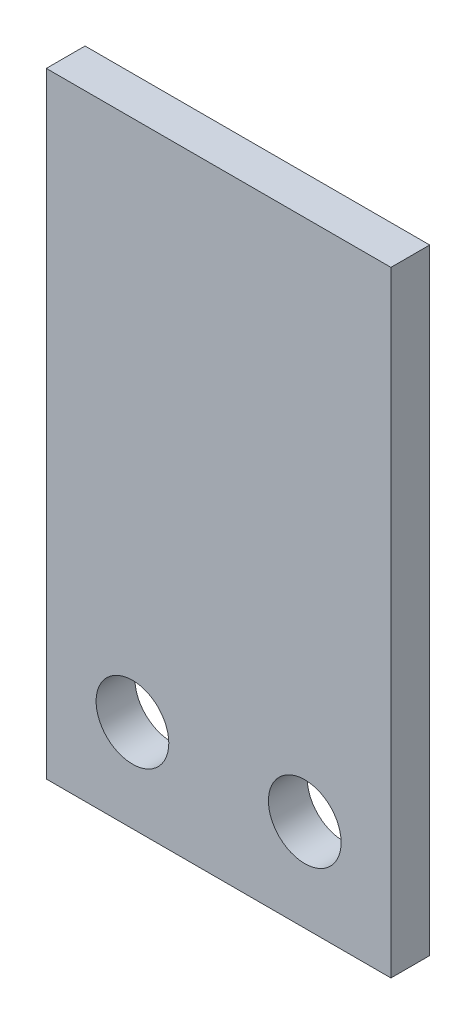
ISO-10303-21;
HEADER;
FILE_DESCRIPTION(('STEP AP214'),'2;1');
FILE_NAME('part.step','',(''),(''),'','','');
FILE_SCHEMA(('AUTOMOTIVE_DESIGN { 1 0 10303 214 1 1 1 1 }'));
ENDSEC;
DATA;
#1=APPLICATION_CONTEXT('core data for automotive mechanical design processes');
#2=APPLICATION_PROTOCOL_DEFINITION('international standard','automotive_design',2000,#1);
#3=PRODUCT_CONTEXT('',#1,'mechanical');
#4=PRODUCT('Part','Part','',(#3));
#5=PRODUCT_RELATED_PRODUCT_CATEGORY('part','',(#4));
#6=PRODUCT_DEFINITION_FORMATION('','',#4);
#7=PRODUCT_DEFINITION_CONTEXT('part definition',#1,'design');
#8=PRODUCT_DEFINITION('design','',#6,#7);
#9=PRODUCT_DEFINITION_SHAPE('','',#8);
#10=(LENGTH_UNIT() NAMED_UNIT(*) SI_UNIT(.MILLI.,.METRE.));
#11=(NAMED_UNIT(*) PLANE_ANGLE_UNIT() SI_UNIT($,.RADIAN.));
#12=(NAMED_UNIT(*) SI_UNIT($,.STERADIAN.) SOLID_ANGLE_UNIT());
#13=UNCERTAINTY_MEASURE_WITH_UNIT(LENGTH_MEASURE(1.E-05),#10,'distance_accuracy_value','');
#14=(GEOMETRIC_REPRESENTATION_CONTEXT(3) GLOBAL_UNCERTAINTY_ASSIGNED_CONTEXT((#13)) GLOBAL_UNIT_ASSIGNED_CONTEXT((#10,
#11,#12)) REPRESENTATION_CONTEXT('',''));
#15=CARTESIAN_POINT('',(0.,0.,0.));
#16=DIRECTION('',(0.,0.,1.));
#17=DIRECTION('',(1.,0.,0.));
#18=AXIS2_PLACEMENT_3D('',#15,#16,#17);
#19=CARTESIAN_POINT('',(0.,0.,1.6));
#20=DIRECTION('',(0.,0.,-1.));
#21=DIRECTION('',(-1.,0.,0.));
#22=AXIS2_PLACEMENT_3D('',#19,#20,#21);
#23=PLANE('',#22);
#24=CARTESIAN_POINT('',(-3.556,-8.89,1.6));
#25=DIRECTION('',(0.,0.,1.));
#26=DIRECTION('',(1.,0.,0.));
#27=AXIS2_PLACEMENT_3D('',#24,#25,#26);
#28=CIRCLE('',#27,1.5);
#29=CARTESIAN_POINT('',(-2.056,-8.89,1.6));
#30=VERTEX_POINT('',#29);
#31=EDGE_CURVE('E100',#30,#30,#28,.T.);
#32=ORIENTED_EDGE('',*,*,#31,.F.);
#33=EDGE_LOOP('',(#32));
#34=FACE_BOUND('',#33,.T.);
#35=DIRECTION('',(0.,1.,0.));
#36=VECTOR('',#35,1.);
#37=CARTESIAN_POINT('',(7.112,-12.7,1.6));
#38=LINE('',#37,#36);
#39=CARTESIAN_POINT('',(7.112,-12.7,1.6));
#40=VERTEX_POINT('',#39);
#41=CARTESIAN_POINT('',(7.112,12.7,1.6));
#42=VERTEX_POINT('',#41);
#43=EDGE_CURVE('E85',#40,#42,#38,.T.);
#44=ORIENTED_EDGE('',*,*,#43,.T.);
#45=DIRECTION('',(-1.,0.,0.));
#46=VECTOR('',#45,1.);
#47=CARTESIAN_POINT('',(-7.112,12.7,1.6));
#48=LINE('',#47,#46);
#49=CARTESIAN_POINT('',(-7.112,12.7,1.6));
#50=VERTEX_POINT('',#49);
#51=EDGE_CURVE('E80',#42,#50,#48,.T.);
#52=ORIENTED_EDGE('',*,*,#51,.T.);
#53=DIRECTION('',(0.,-1.,0.));
#54=VECTOR('',#53,1.);
#55=CARTESIAN_POINT('',(-7.112,-12.7,1.6));
#56=LINE('',#55,#54);
#57=CARTESIAN_POINT('',(-7.112,-12.7,1.6));
#58=VERTEX_POINT('',#57);
#59=EDGE_CURVE('E83',#50,#58,#56,.T.);
#60=ORIENTED_EDGE('',*,*,#59,.T.);
#61=DIRECTION('',(1.,0.,0.));
#62=VECTOR('',#61,1.);
#63=CARTESIAN_POINT('',(-7.112,-12.7,1.6));
#64=LINE('',#63,#62);
#65=EDGE_CURVE('E50',#58,#40,#64,.T.);
#66=ORIENTED_EDGE('',*,*,#65,.T.);
#67=EDGE_LOOP('',(#44,#52,#60,#66));
#68=FACE_BOUND('',#67,.T.);
#69=CARTESIAN_POINT('',(3.556,-8.89,1.6));
#70=DIRECTION('',(0.,0.,1.));
#71=DIRECTION('',(1.,0.,0.));
#72=AXIS2_PLACEMENT_3D('',#69,#70,#71);
#73=CIRCLE('',#72,1.5);
#74=CARTESIAN_POINT('',(5.056,-8.89,1.6));
#75=VERTEX_POINT('',#74);
#76=EDGE_CURVE('E115',#75,#75,#73,.T.);
#77=ORIENTED_EDGE('',*,*,#76,.F.);
#78=EDGE_LOOP('',(#77));
#79=FACE_BOUND('',#78,.T.);
#80=ADVANCED_FACE('F33',(#34,#68,#79),#23,.F.);
#81=CARTESIAN_POINT('',(0.,0.,0.));
#82=DIRECTION('',(0.,0.,-1.));
#83=DIRECTION('',(-1.,0.,0.));
#84=AXIS2_PLACEMENT_3D('',#81,#82,#83);
#85=PLANE('',#84);
#86=CARTESIAN_POINT('',(-3.556,-8.89,0.));
#87=DIRECTION('',(0.,0.,1.));
#88=DIRECTION('',(1.,0.,0.));
#89=AXIS2_PLACEMENT_3D('',#86,#87,#88);
#90=CIRCLE('',#89,1.5);
#91=CARTESIAN_POINT('',(-2.056,-8.89,0.));
#92=VERTEX_POINT('',#91);
#93=EDGE_CURVE('E112',#92,#92,#90,.T.);
#94=ORIENTED_EDGE('',*,*,#93,.T.);
#95=EDGE_LOOP('',(#94));
#96=FACE_BOUND('',#95,.T.);
#97=DIRECTION('',(0.,1.,0.));
#98=VECTOR('',#97,1.);
#99=CARTESIAN_POINT('',(7.112,-12.7,0.));
#100=LINE('',#99,#98);
#101=CARTESIAN_POINT('',(7.112,-12.7,0.));
#102=VERTEX_POINT('',#101);
#103=CARTESIAN_POINT('',(7.112,12.7,0.));
#104=VERTEX_POINT('',#103);
#105=EDGE_CURVE('E97',#102,#104,#100,.T.);
#106=ORIENTED_EDGE('',*,*,#105,.F.);
#107=DIRECTION('',(1.,0.,0.));
#108=VECTOR('',#107,1.);
#109=CARTESIAN_POINT('',(-7.112,-12.7,0.));
#110=LINE('',#109,#108);
#111=CARTESIAN_POINT('',(-7.112,-12.7,0.));
#112=VERTEX_POINT('',#111);
#113=EDGE_CURVE('E73',#112,#102,#110,.T.);
#114=ORIENTED_EDGE('',*,*,#113,.F.);
#115=DIRECTION('',(0.,-1.,0.));
#116=VECTOR('',#115,1.);
#117=CARTESIAN_POINT('',(-7.112,-12.7,0.));
#118=LINE('',#117,#116);
#119=CARTESIAN_POINT('',(-7.112,12.7,0.));
#120=VERTEX_POINT('',#119);
#121=EDGE_CURVE('E67',#120,#112,#118,.T.);
#122=ORIENTED_EDGE('',*,*,#121,.F.);
#123=DIRECTION('',(-1.,0.,0.));
#124=VECTOR('',#123,1.);
#125=CARTESIAN_POINT('',(-7.112,12.7,0.));
#126=LINE('',#125,#124);
#127=EDGE_CURVE('E89',#104,#120,#126,.T.);
#128=ORIENTED_EDGE('',*,*,#127,.F.);
#129=EDGE_LOOP('',(#106,#114,#122,#128));
#130=FACE_BOUND('',#129,.T.);
#131=CARTESIAN_POINT('',(3.556,-8.89,0.));
#132=DIRECTION('',(0.,0.,1.));
#133=DIRECTION('',(1.,0.,0.));
#134=AXIS2_PLACEMENT_3D('',#131,#132,#133);
#135=CIRCLE('',#134,1.5);
#136=CARTESIAN_POINT('',(5.056,-8.89,0.));
#137=VERTEX_POINT('',#136);
#138=EDGE_CURVE('E118',#137,#137,#135,.T.);
#139=ORIENTED_EDGE('',*,*,#138,.T.);
#140=EDGE_LOOP('',(#139));
#141=FACE_BOUND('',#140,.T.);
#142=ADVANCED_FACE('F108',(#96,#130,#141),#85,.T.);
#143=CARTESIAN_POINT('',(7.112,-12.7,1.6));
#144=DIRECTION('',(-1.,0.,0.));
#145=DIRECTION('',(0.,0.,1.));
#146=AXIS2_PLACEMENT_3D('',#143,#144,#145);
#147=PLANE('',#146);
#148=ORIENTED_EDGE('',*,*,#105,.T.);
#149=DIRECTION('',(0.,0.,-1.));
#150=VECTOR('',#149,1.);
#151=CARTESIAN_POINT('',(7.112,12.7,1.6));
#152=LINE('',#151,#150);
#153=EDGE_CURVE('E11',#42,#104,#152,.T.);
#154=ORIENTED_EDGE('',*,*,#153,.F.);
#155=ORIENTED_EDGE('',*,*,#43,.F.);
#156=DIRECTION('',(0.,0.,-1.));
#157=VECTOR('',#156,1.);
#158=CARTESIAN_POINT('',(7.112,-12.7,1.6));
#159=LINE('',#158,#157);
#160=EDGE_CURVE('E93',#40,#102,#159,.T.);
#161=ORIENTED_EDGE('',*,*,#160,.T.);
#162=EDGE_LOOP('',(#148,#154,#155,#161));
#163=FACE_BOUND('',#162,.T.);
#164=ADVANCED_FACE('F35',(#163),#147,.F.);
#165=CARTESIAN_POINT('',(-7.112,12.7,1.6));
#166=DIRECTION('',(0.,-1.,0.));
#167=DIRECTION('',(0.,0.,-1.));
#168=AXIS2_PLACEMENT_3D('',#165,#166,#167);
#169=PLANE('',#168);
#170=ORIENTED_EDGE('',*,*,#127,.T.);
#171=DIRECTION('',(0.,0.,-1.));
#172=VECTOR('',#171,1.);
#173=CARTESIAN_POINT('',(-7.112,12.7,1.6));
#174=LINE('',#173,#172);
#175=EDGE_CURVE('E42',#50,#120,#174,.T.);
#176=ORIENTED_EDGE('',*,*,#175,.F.);
#177=ORIENTED_EDGE('',*,*,#51,.F.);
#178=ORIENTED_EDGE('',*,*,#153,.T.);
#179=EDGE_LOOP('',(#170,#176,#177,#178));
#180=FACE_BOUND('',#179,.T.);
#181=ADVANCED_FACE('F88',(#180),#169,.F.);
#182=CARTESIAN_POINT('',(-7.112,-12.7,1.6));
#183=DIRECTION('',(1.,0.,0.));
#184=DIRECTION('',(0.,0.,-1.));
#185=AXIS2_PLACEMENT_3D('',#182,#183,#184);
#186=PLANE('',#185);
#187=ORIENTED_EDGE('',*,*,#121,.T.);
#188=DIRECTION('',(0.,0.,-1.));
#189=VECTOR('',#188,1.);
#190=CARTESIAN_POINT('',(-7.112,-12.7,1.6));
#191=LINE('',#190,#189);
#192=EDGE_CURVE('E90',#58,#112,#191,.T.);
#193=ORIENTED_EDGE('',*,*,#192,.F.);
#194=ORIENTED_EDGE('',*,*,#59,.F.);
#195=ORIENTED_EDGE('',*,*,#175,.T.);
#196=EDGE_LOOP('',(#187,#193,#194,#195));
#197=FACE_BOUND('',#196,.T.);
#198=ADVANCED_FACE('F91',(#197),#186,.F.);
#199=CARTESIAN_POINT('',(-7.112,-12.7,1.6));
#200=DIRECTION('',(0.,1.,0.));
#201=DIRECTION('',(0.,0.,1.));
#202=AXIS2_PLACEMENT_3D('',#199,#200,#201);
#203=PLANE('',#202);
#204=ORIENTED_EDGE('',*,*,#113,.T.);
#205=ORIENTED_EDGE('',*,*,#160,.F.);
#206=ORIENTED_EDGE('',*,*,#65,.F.);
#207=ORIENTED_EDGE('',*,*,#192,.T.);
#208=EDGE_LOOP('',(#204,#205,#206,#207));
#209=FACE_BOUND('',#208,.T.);
#210=ADVANCED_FACE('F105',(#209),#203,.F.);
#211=CARTESIAN_POINT('',(-3.556,-8.89,1.6));
#212=DIRECTION('',(0.,0.,-1.));
#213=DIRECTION('',(-1.,0.,0.));
#214=AXIS2_PLACEMENT_3D('',#211,#212,#213);
#215=CYLINDRICAL_SURFACE('',#214,1.5);
#216=ORIENTED_EDGE('',*,*,#31,.T.);
#217=EDGE_LOOP('',(#216));
#218=FACE_BOUND('',#217,.T.);
#219=ORIENTED_EDGE('',*,*,#93,.F.);
#220=EDGE_LOOP('',(#219));
#221=FACE_BOUND('',#220,.T.);
#222=ADVANCED_FACE('F136',(#218,#221),#215,.F.);
#223=CARTESIAN_POINT('',(3.556,-8.89,1.6));
#224=DIRECTION('',(0.,0.,-1.));
#225=DIRECTION('',(-1.,0.,0.));
#226=AXIS2_PLACEMENT_3D('',#223,#224,#225);
#227=CYLINDRICAL_SURFACE('',#226,1.5);
#228=ORIENTED_EDGE('',*,*,#76,.T.);
#229=EDGE_LOOP('',(#228));
#230=FACE_BOUND('',#229,.T.);
#231=ORIENTED_EDGE('',*,*,#138,.F.);
#232=EDGE_LOOP('',(#231));
#233=FACE_BOUND('',#232,.T.);
#234=ADVANCED_FACE('F124',(#230,#233),#227,.F.);
#235=CLOSED_SHELL('',(#80,#142,#164,#181,#198,#210,#222,#234));
#236=MANIFOLD_SOLID_BREP('B2',#235);
#237=ADVANCED_BREP_SHAPE_REPRESENTATION('',(#18,#236),#14);
#238=SHAPE_DEFINITION_REPRESENTATION(#9,#237);
ENDSEC;
END-ISO-10303-21;
